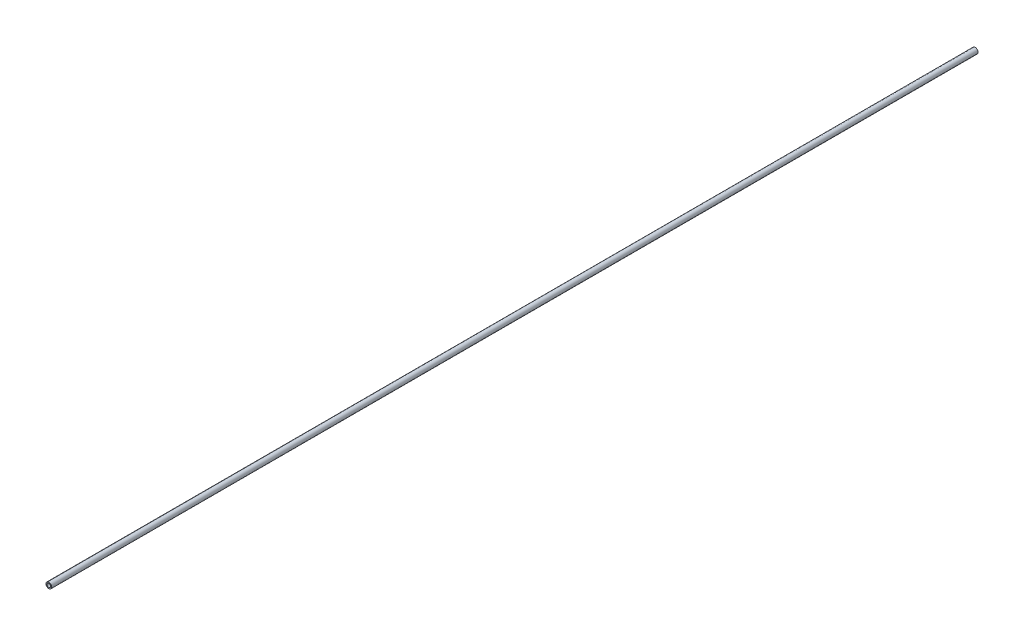
ISO-10303-21;
HEADER;
FILE_DESCRIPTION(('STEP AP214'),'2;1');
FILE_NAME('part.step','',(''),(''),'','','');
FILE_SCHEMA(('AUTOMOTIVE_DESIGN { 1 0 10303 214 1 1 1 1 }'));
ENDSEC;
DATA;
#1=APPLICATION_CONTEXT('core data for automotive mechanical design processes');
#2=APPLICATION_PROTOCOL_DEFINITION('international standard','automotive_design',2000,#1);
#3=PRODUCT_CONTEXT('',#1,'mechanical');
#4=PRODUCT('Part','Part','',(#3));
#5=PRODUCT_RELATED_PRODUCT_CATEGORY('part','',(#4));
#6=PRODUCT_DEFINITION_FORMATION('','',#4);
#7=PRODUCT_DEFINITION_CONTEXT('part definition',#1,'design');
#8=PRODUCT_DEFINITION('design','',#6,#7);
#9=PRODUCT_DEFINITION_SHAPE('','',#8);
#10=(LENGTH_UNIT() NAMED_UNIT(*) SI_UNIT(.MILLI.,.METRE.));
#11=(NAMED_UNIT(*) PLANE_ANGLE_UNIT() SI_UNIT($,.RADIAN.));
#12=(NAMED_UNIT(*) SI_UNIT($,.STERADIAN.) SOLID_ANGLE_UNIT());
#13=UNCERTAINTY_MEASURE_WITH_UNIT(LENGTH_MEASURE(1.E-05),#10,'distance_accuracy_value','');
#14=(GEOMETRIC_REPRESENTATION_CONTEXT(3) GLOBAL_UNCERTAINTY_ASSIGNED_CONTEXT((#13)) GLOBAL_UNIT_ASSIGNED_CONTEXT((#10,
#11,#12)) REPRESENTATION_CONTEXT('',''));
#15=CARTESIAN_POINT('',(0.,0.,0.));
#16=DIRECTION('',(0.,0.,1.));
#17=DIRECTION('',(1.,0.,0.));
#18=AXIS2_PLACEMENT_3D('',#15,#16,#17);
#19=CARTESIAN_POINT('',(0.,0.,5486.4));
#20=DIRECTION('',(0.,0.,1.));
#21=DIRECTION('',(1.,0.,0.));
#22=AXIS2_PLACEMENT_3D('',#19,#20,#21);
#23=PLANE('',#22);
#24=CARTESIAN_POINT('',(0.,0.,5486.4));
#25=DIRECTION('',(0.,0.,1.));
#26=DIRECTION('',(1.,0.,0.));
#27=AXIS2_PLACEMENT_3D('',#24,#25,#26);
#28=CIRCLE('',#27,16.764);
#29=CARTESIAN_POINT('',(16.764,0.,5486.4));
#30=VERTEX_POINT('',#29);
#31=EDGE_CURVE('E10',#30,#30,#28,.T.);
#32=ORIENTED_EDGE('',*,*,#31,.T.);
#33=EDGE_LOOP('',(#32));
#34=FACE_BOUND('',#33,.T.);
#35=CARTESIAN_POINT('',(0.,0.,5486.4));
#36=DIRECTION('',(0.,0.,1.));
#37=DIRECTION('',(1.,0.,0.));
#38=AXIS2_PLACEMENT_3D('',#35,#36,#37);
#39=CIRCLE('',#38,10.414);
#40=CARTESIAN_POINT('',(10.414,0.,5486.4));
#41=VERTEX_POINT('',#40);
#42=EDGE_CURVE('E39',#41,#41,#39,.T.);
#43=ORIENTED_EDGE('',*,*,#42,.F.);
#44=EDGE_LOOP('',(#43));
#45=FACE_BOUND('',#44,.T.);
#46=ADVANCED_FACE('F28',(#34,#45),#23,.T.);
#47=CARTESIAN_POINT('',(0.,0.,0.));
#48=DIRECTION('',(0.,0.,1.));
#49=DIRECTION('',(1.,0.,0.));
#50=AXIS2_PLACEMENT_3D('',#47,#48,#49);
#51=PLANE('',#50);
#52=CARTESIAN_POINT('',(0.,0.,0.));
#53=DIRECTION('',(0.,0.,1.));
#54=DIRECTION('',(1.,0.,0.));
#55=AXIS2_PLACEMENT_3D('',#52,#53,#54);
#56=CIRCLE('',#55,16.764);
#57=CARTESIAN_POINT('',(16.764,0.,0.));
#58=VERTEX_POINT('',#57);
#59=EDGE_CURVE('E32',#58,#58,#56,.T.);
#60=ORIENTED_EDGE('',*,*,#59,.F.);
#61=EDGE_LOOP('',(#60));
#62=FACE_BOUND('',#61,.T.);
#63=CARTESIAN_POINT('',(0.,0.,0.));
#64=DIRECTION('',(0.,0.,1.));
#65=DIRECTION('',(1.,0.,0.));
#66=AXIS2_PLACEMENT_3D('',#63,#64,#65);
#67=CIRCLE('',#66,10.414);
#68=CARTESIAN_POINT('',(10.414,0.,0.));
#69=VERTEX_POINT('',#68);
#70=EDGE_CURVE('E41',#69,#69,#67,.T.);
#71=ORIENTED_EDGE('',*,*,#70,.T.);
#72=EDGE_LOOP('',(#71));
#73=FACE_BOUND('',#72,.T.);
#74=ADVANCED_FACE('F51',(#62,#73),#51,.F.);
#75=CARTESIAN_POINT('',(0.,0.,5486.4));
#76=DIRECTION('',(0.,0.,-1.));
#77=DIRECTION('',(-1.,0.,0.));
#78=AXIS2_PLACEMENT_3D('',#75,#76,#77);
#79=CYLINDRICAL_SURFACE('',#78,16.764);
#80=ORIENTED_EDGE('',*,*,#31,.F.);
#81=EDGE_LOOP('',(#80));
#82=FACE_BOUND('',#81,.T.);
#83=ORIENTED_EDGE('',*,*,#59,.T.);
#84=EDGE_LOOP('',(#83));
#85=FACE_BOUND('',#84,.T.);
#86=ADVANCED_FACE('F30',(#82,#85),#79,.T.);
#87=CARTESIAN_POINT('',(0.,0.,5486.4));
#88=DIRECTION('',(0.,0.,-1.));
#89=DIRECTION('',(-1.,0.,0.));
#90=AXIS2_PLACEMENT_3D('',#87,#88,#89);
#91=CYLINDRICAL_SURFACE('',#90,10.414);
#92=ORIENTED_EDGE('',*,*,#42,.T.);
#93=EDGE_LOOP('',(#92));
#94=FACE_BOUND('',#93,.T.);
#95=ORIENTED_EDGE('',*,*,#70,.F.);
#96=EDGE_LOOP('',(#95));
#97=FACE_BOUND('',#96,.T.);
#98=ADVANCED_FACE('F47',(#94,#97),#91,.F.);
#99=CLOSED_SHELL('',(#46,#74,#86,#98));
#100=MANIFOLD_SOLID_BREP('B2',#99);
#101=ADVANCED_BREP_SHAPE_REPRESENTATION('',(#18,#100),#14);
#102=SHAPE_DEFINITION_REPRESENTATION(#9,#101);
ENDSEC;
END-ISO-10303-21;
